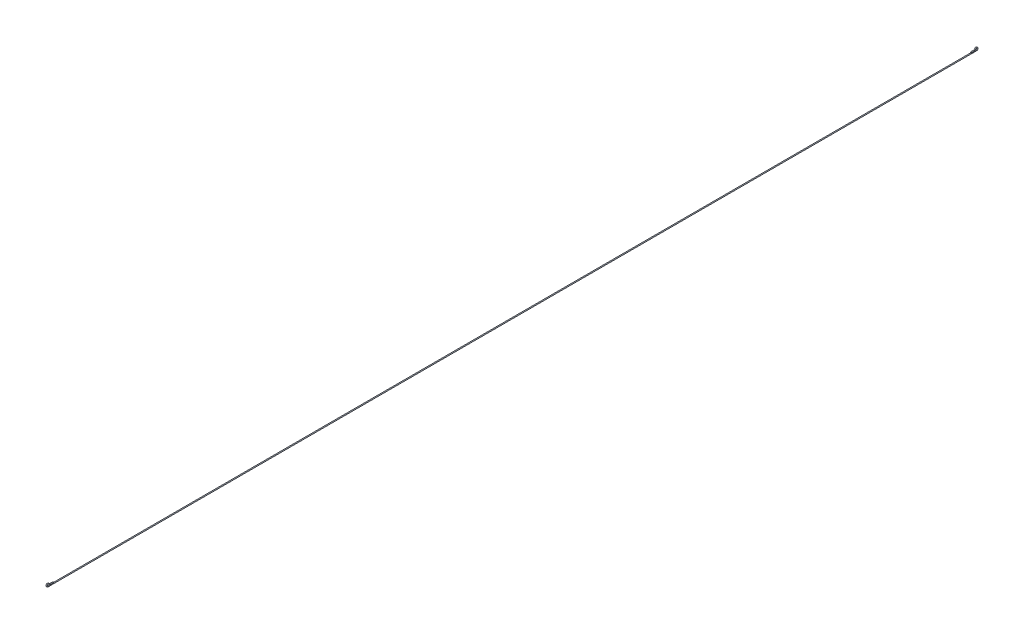
ISO-10303-21;
HEADER;
FILE_DESCRIPTION(('STEP AP214'),'2;1');
FILE_NAME('part.step','',(''),(''),'','','');
FILE_SCHEMA(('AUTOMOTIVE_DESIGN { 1 0 10303 214 1 1 1 1 }'));
ENDSEC;
DATA;
#1=APPLICATION_CONTEXT('core data for automotive mechanical design processes');
#2=APPLICATION_PROTOCOL_DEFINITION('international standard','automotive_design',2000,#1);
#3=PRODUCT_CONTEXT('',#1,'mechanical');
#4=PRODUCT('Part','Part','',(#3));
#5=PRODUCT_RELATED_PRODUCT_CATEGORY('part','',(#4));
#6=PRODUCT_DEFINITION_FORMATION('','',#4);
#7=PRODUCT_DEFINITION_CONTEXT('part definition',#1,'design');
#8=PRODUCT_DEFINITION('design','',#6,#7);
#9=PRODUCT_DEFINITION_SHAPE('','',#8);
#10=(LENGTH_UNIT() NAMED_UNIT(*) SI_UNIT(.MILLI.,.METRE.));
#11=(NAMED_UNIT(*) PLANE_ANGLE_UNIT() SI_UNIT($,.RADIAN.));
#12=(NAMED_UNIT(*) SI_UNIT($,.STERADIAN.) SOLID_ANGLE_UNIT());
#13=UNCERTAINTY_MEASURE_WITH_UNIT(LENGTH_MEASURE(1.E-05),#10,'distance_accuracy_value','');
#14=(GEOMETRIC_REPRESENTATION_CONTEXT(3) GLOBAL_UNCERTAINTY_ASSIGNED_CONTEXT((#13)) GLOBAL_UNIT_ASSIGNED_CONTEXT((#10,
#11,#12)) REPRESENTATION_CONTEXT('',''));
#15=CARTESIAN_POINT('',(0.,0.,0.));
#16=DIRECTION('',(0.,0.,1.));
#17=DIRECTION('',(1.,0.,0.));
#18=AXIS2_PLACEMENT_3D('',#15,#16,#17);
#19=CARTESIAN_POINT('',(0.,-3.,17.4161984870956));
#20=DIRECTION('',(0.,0.,-1.));
#21=DIRECTION('',(0.,1.,0.));
#22=AXIS2_PLACEMENT_3D('',#19,#20,#21);
#23=CYLINDRICAL_SURFACE('',#22,1.5);
#24=CARTESIAN_POINT('',(0.,-3.,17.4161984870956));
#25=DIRECTION('',(0.,0.,-1.));
#26=DIRECTION('',(1.,0.,0.));
#27=AXIS2_PLACEMENT_3D('',#24,#25,#26);
#28=CIRCLE('',#27,1.5);
#29=CARTESIAN_POINT('',(0.,-4.5,17.4161984870956));
#30=VERTEX_POINT('',#29);
#31=EDGE_CURVE('E10',#30,#30,#28,.T.);
#32=ORIENTED_EDGE('',*,*,#31,.T.);
#33=EDGE_LOOP('',(#32));
#34=FACE_BOUND('',#33,.T.);
#35=CARTESIAN_POINT('',(0.,-2.99999999996059,-3128.5838015129));
#36=DIRECTION('',(0.,0.,-1.));
#37=DIRECTION('',(1.,0.,0.));
#38=AXIS2_PLACEMENT_3D('',#35,#36,#37);
#39=CIRCLE('',#38,1.5);
#40=CARTESIAN_POINT('',(0.,-4.49999999996036,-3128.5838015129));
#41=VERTEX_POINT('',#40);
#42=EDGE_CURVE('E49',#41,#41,#39,.T.);
#43=ORIENTED_EDGE('',*,*,#42,.F.);
#44=EDGE_LOOP('',(#43));
#45=FACE_BOUND('',#44,.T.);
#46=ADVANCED_FACE('F31',(#34,#45),#23,.T.);
#47=CARTESIAN_POINT('',(0.,1.,17.4161984870957));
#48=DIRECTION('',(1.,0.,0.));
#49=DIRECTION('',(0.,0.,-1.));
#50=AXIS2_PLACEMENT_3D('',#47,#48,#49);
#51=TOROIDAL_SURFACE('',#50,4.,1.5);
#52=CARTESIAN_POINT('',(0.,2.5,13.7080992435478));
#53=DIRECTION('',(0.,0.927024810886958,0.374999999999999));
#54=DIRECTION('',(1.,0.,0.));
#55=AXIS2_PLACEMENT_3D('',#52,#53,#54);
#56=CIRCLE('',#55,1.5);
#57=CARTESIAN_POINT('',(0.,3.0625,12.3175620272174));
#58=VERTEX_POINT('',#57);
#59=EDGE_CURVE('E37',#58,#58,#56,.T.);
#60=CARTESIAN_POINT('',(0.,1.,17.4161984870957));
#61=DIRECTION('',(1.,0.,0.));
#62=DIRECTION('',(0.,0.,-1.));
#63=AXIS2_PLACEMENT_3D('',#60,#61,#62);
#64=CIRCLE('',#63,5.5);
#65=EDGE_CURVE('',#58,#30,#64,.T.);
#66=ORIENTED_EDGE('',*,*,#59,.T.);
#67=ORIENTED_EDGE('',*,*,#31,.F.);
#68=ORIENTED_EDGE('',*,*,#65,.T.);
#69=ORIENTED_EDGE('',*,*,#65,.F.);
#70=EDGE_LOOP('',(#66,#68,#67,#69));
#71=FACE_BOUND('',#70,.T.);
#72=ADVANCED_FACE('F80',(#71),#51,.T.);
#73=CARTESIAN_POINT('',(0.,4.,10.));
#74=DIRECTION('',(-1.,0.,0.));
#75=DIRECTION('',(0.,0.,1.));
#76=AXIS2_PLACEMENT_3D('',#73,#74,#75);
#77=TOROIDAL_SURFACE('',#76,4.,1.5);
#78=CARTESIAN_POINT('',(0.,0.,10.));
#79=DIRECTION('',(0.,0.,1.));
#80=DIRECTION('',(1.,0.,0.));
#81=AXIS2_PLACEMENT_3D('',#78,#79,#80);
#82=CIRCLE('',#81,1.5);
#83=CARTESIAN_POINT('',(1.5,0.,10.));
#84=VERTEX_POINT('',#83);
#85=EDGE_CURVE('E41',#84,#84,#82,.T.);
#86=ORIENTED_EDGE('',*,*,#85,.T.);
#87=EDGE_LOOP('',(#86));
#88=FACE_BOUND('',#87,.T.);
#89=ORIENTED_EDGE('',*,*,#59,.F.);
#90=EDGE_LOOP('',(#89));
#91=FACE_BOUND('',#90,.T.);
#92=ADVANCED_FACE('F84',(#88,#91),#77,.T.);
#93=CARTESIAN_POINT('',(0.,0.,10.));
#94=DIRECTION('',(0.,0.,-1.));
#95=DIRECTION('',(-1.,0.,0.));
#96=AXIS2_PLACEMENT_3D('',#93,#94,#95);
#97=CYLINDRICAL_SURFACE('',#96,1.5);
#98=ORIENTED_EDGE('',*,*,#85,.F.);
#99=EDGE_LOOP('',(#98));
#100=FACE_BOUND('',#99,.T.);
#101=CARTESIAN_POINT('',(0.,0.,0.));
#102=DIRECTION('',(0.,0.,1.));
#103=DIRECTION('',(1.,0.,0.));
#104=AXIS2_PLACEMENT_3D('',#101,#102,#103);
#105=CIRCLE('',#104,1.5);
#106=CARTESIAN_POINT('',(1.5,0.,0.));
#107=VERTEX_POINT('',#106);
#108=EDGE_CURVE('E45',#107,#107,#105,.T.);
#109=ORIENTED_EDGE('',*,*,#108,.T.);
#110=EDGE_LOOP('',(#109));
#111=FACE_BOUND('',#110,.T.);
#112=ADVANCED_FACE('F88',(#100,#111),#97,.T.);
#113=CARTESIAN_POINT('',(0.,0.,0.));
#114=DIRECTION('',(0.,0.,1.));
#115=DIRECTION('',(1.,0.,0.));
#116=AXIS2_PLACEMENT_3D('',#113,#114,#115);
#117=PLANE('',#116);
#118=ORIENTED_EDGE('',*,*,#108,.F.);
#119=EDGE_LOOP('',(#118));
#120=FACE_BOUND('',#119,.T.);
#121=ADVANCED_FACE('F75',(#120),#117,.F.);
#122=CARTESIAN_POINT('',(0.,1.00000000003947,-3128.5838015129));
#123=DIRECTION('',(-1.,0.,0.));
#124=DIRECTION('',(0.,0.,1.));
#125=AXIS2_PLACEMENT_3D('',#122,#123,#124);
#126=TOROIDAL_SURFACE('',#125,3.99999999999983,1.5);
#127=CARTESIAN_POINT('',(0.,2.50000000003947,-3124.87570226936));
#128=DIRECTION('',(0.,-0.927024810886985,0.374999999999933));
#129=DIRECTION('',(1.,0.,0.));
#130=AXIS2_PLACEMENT_3D('',#127,#128,#129);
#131=CIRCLE('',#130,1.5);
#132=CARTESIAN_POINT('',(0.,3.0625000000395,-3123.48516505303));
#133=VERTEX_POINT('',#132);
#134=EDGE_CURVE('E53',#133,#133,#131,.T.);
#135=CARTESIAN_POINT('',(0.,1.00000000003947,-3128.5838015129));
#136=DIRECTION('',(-1.,0.,0.));
#137=DIRECTION('',(0.,0.,1.));
#138=AXIS2_PLACEMENT_3D('',#135,#136,#137);
#139=CIRCLE('',#138,5.49999999999983);
#140=EDGE_CURVE('',#133,#41,#139,.T.);
#141=ORIENTED_EDGE('',*,*,#134,.F.);
#142=ORIENTED_EDGE('',*,*,#42,.T.);
#143=ORIENTED_EDGE('',*,*,#140,.T.);
#144=ORIENTED_EDGE('',*,*,#140,.F.);
#145=EDGE_LOOP('',(#141,#143,#142,#144));
#146=FACE_BOUND('',#145,.T.);
#147=ADVANCED_FACE('F69',(#146),#126,.T.);
#148=CARTESIAN_POINT('',(0.,4.00000000003928,-3121.16760302581));
#149=DIRECTION('',(1.,0.,0.));
#150=DIRECTION('',(0.,0.,-1.));
#151=AXIS2_PLACEMENT_3D('',#148,#149,#150);
#152=TOROIDAL_SURFACE('',#151,4.,1.5);
#153=CARTESIAN_POINT('',(0.,3.92821263452876E-11,-3121.16760302581));
#154=DIRECTION('',(0.,0.,1.));
#155=DIRECTION('',(1.,0.,0.));
#156=AXIS2_PLACEMENT_3D('',#153,#154,#155);
#157=CIRCLE('',#156,1.5);
#158=CARTESIAN_POINT('',(1.5,3.92821263452876E-11,-3121.16760302581));
#159=VERTEX_POINT('',#158);
#160=EDGE_CURVE('E56',#159,#159,#157,.T.);
#161=ORIENTED_EDGE('',*,*,#160,.F.);
#162=EDGE_LOOP('',(#161));
#163=FACE_BOUND('',#162,.T.);
#164=ORIENTED_EDGE('',*,*,#134,.T.);
#165=EDGE_LOOP('',(#164));
#166=FACE_BOUND('',#165,.T.);
#167=ADVANCED_FACE('F66',(#163,#166),#152,.T.);
#168=CARTESIAN_POINT('',(0.,3.92821263452876E-11,-3121.16760302581));
#169=DIRECTION('',(0.,0.,1.));
#170=DIRECTION('',(0.,-1.,0.));
#171=AXIS2_PLACEMENT_3D('',#168,#169,#170);
#172=CYLINDRICAL_SURFACE('',#171,1.5);
#173=ORIENTED_EDGE('',*,*,#160,.T.);
#174=EDGE_LOOP('',(#173));
#175=FACE_BOUND('',#174,.T.);
#176=CARTESIAN_POINT('',(0.,3.90312159417224E-11,-3111.16760302581));
#177=DIRECTION('',(0.,0.,1.));
#178=DIRECTION('',(1.,0.,0.));
#179=AXIS2_PLACEMENT_3D('',#176,#177,#178);
#180=CIRCLE('',#179,1.5);
#181=CARTESIAN_POINT('',(1.5,3.90312159417224E-11,-3111.16760302581));
#182=VERTEX_POINT('',#181);
#183=EDGE_CURVE('E57',#182,#182,#180,.T.);
#184=ORIENTED_EDGE('',*,*,#183,.F.);
#185=EDGE_LOOP('',(#184));
#186=FACE_BOUND('',#185,.T.);
#187=ADVANCED_FACE('F63',(#175,#186),#172,.T.);
#188=CARTESIAN_POINT('',(0.,3.90312159417224E-11,-3111.16760302581));
#189=DIRECTION('',(0.,0.,-1.));
#190=DIRECTION('',(1.,0.,0.));
#191=AXIS2_PLACEMENT_3D('',#188,#189,#190);
#192=PLANE('',#191);
#193=ORIENTED_EDGE('',*,*,#183,.T.);
#194=EDGE_LOOP('',(#193));
#195=FACE_BOUND('',#194,.T.);
#196=ADVANCED_FACE('F101',(#195),#192,.F.);
#197=CLOSED_SHELL('',(#46,#72,#92,#112,#121,#147,#167,#187,#196));
#198=MANIFOLD_SOLID_BREP('B2',#197);
#199=ADVANCED_BREP_SHAPE_REPRESENTATION('',(#18,#198),#14);
#200=SHAPE_DEFINITION_REPRESENTATION(#9,#199);
ENDSEC;
END-ISO-10303-21;
